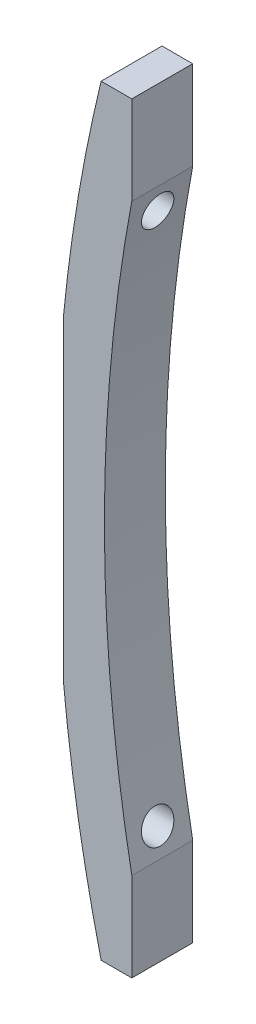
ISO-10303-21;
HEADER;
FILE_DESCRIPTION(('STEP AP214'),'2;1');
FILE_NAME('part.step','',(''),(''),'','','');
FILE_SCHEMA(('AUTOMOTIVE_DESIGN { 1 0 10303 214 1 1 1 1 }'));
ENDSEC;
DATA;
#1=APPLICATION_CONTEXT('core data for automotive mechanical design processes');
#2=APPLICATION_PROTOCOL_DEFINITION('international standard','automotive_design',2000,#1);
#3=PRODUCT_CONTEXT('',#1,'mechanical');
#4=PRODUCT('Part','Part','',(#3));
#5=PRODUCT_RELATED_PRODUCT_CATEGORY('part','',(#4));
#6=PRODUCT_DEFINITION_FORMATION('','',#4);
#7=PRODUCT_DEFINITION_CONTEXT('part definition',#1,'design');
#8=PRODUCT_DEFINITION('design','',#6,#7);
#9=PRODUCT_DEFINITION_SHAPE('','',#8);
#10=(LENGTH_UNIT() NAMED_UNIT(*) SI_UNIT(.MILLI.,.METRE.));
#11=(NAMED_UNIT(*) PLANE_ANGLE_UNIT() SI_UNIT($,.RADIAN.));
#12=(NAMED_UNIT(*) SI_UNIT($,.STERADIAN.) SOLID_ANGLE_UNIT());
#13=UNCERTAINTY_MEASURE_WITH_UNIT(LENGTH_MEASURE(1.E-05),#10,'distance_accuracy_value','');
#14=(GEOMETRIC_REPRESENTATION_CONTEXT(3) GLOBAL_UNCERTAINTY_ASSIGNED_CONTEXT((#13)) GLOBAL_UNIT_ASSIGNED_CONTEXT((#10,
#11,#12)) REPRESENTATION_CONTEXT('',''));
#15=CARTESIAN_POINT('',(0.,0.,0.));
#16=DIRECTION('',(0.,0.,1.));
#17=DIRECTION('',(1.,0.,0.));
#18=AXIS2_PLACEMENT_3D('',#15,#16,#17);
#19=CARTESIAN_POINT('',(0.,0.,8.));
#20=DIRECTION('',(0.,0.,-1.));
#21=DIRECTION('',(-1.,0.,0.));
#22=AXIS2_PLACEMENT_3D('',#19,#20,#21);
#23=CYLINDRICAL_SURFACE('',#22,212.4);
#24=CARTESIAN_POINT('',(-209.4964438839,35.,1.90000000000001));
#25=CARTESIAN_POINT('',(-209.476511381368,35.1193073421392,1.90000511184123));
#26=CARTESIAN_POINT('',(-209.456461650827,35.2386843955293,1.91019918332409));
#27=CARTESIAN_POINT('',(-209.416713524346,35.4741370640329,1.9507326093201));
#28=CARTESIAN_POINT('',(-209.397015589484,35.5902084502996,1.98109665698785));
#29=CARTESIAN_POINT('',(-209.358577223821,35.8156280588949,2.06117372701381));
#30=CARTESIAN_POINT('',(-209.339836571926,35.9249778348495,2.11088225848665));
#31=CARTESIAN_POINT('',(-209.303896620308,36.1337805423377,2.22830991470027));
#32=CARTESIAN_POINT('',(-209.286696894943,36.2332362077129,2.29602404521435));
#33=CARTESIAN_POINT('',(-209.254481958036,36.4188222934256,2.44720052984125));
#34=CARTESIAN_POINT('',(-209.239455034992,36.5050243241536,2.53057242445303));
#35=CARTESIAN_POINT('',(-209.21197777184,36.6621703871992,2.71100816209119));
#36=CARTESIAN_POINT('',(-209.199527355566,36.7331148705546,2.80807160023294));
#37=CARTESIAN_POINT('',(-209.177792656656,36.8566812951015,3.01170680739767));
#38=CARTESIAN_POINT('',(-209.168467113492,36.9095422226952,3.11812914027043));
#39=CARTESIAN_POINT('',(-209.153080698746,36.9966323230944,3.33856258903509));
#40=CARTESIAN_POINT('',(-209.147019538543,37.0308631430846,3.45257303302202));
#41=CARTESIAN_POINT('',(-209.138442507443,37.0792727421971,3.68325937577144));
#42=CARTESIAN_POINT('',(-209.135879004865,37.0937209341907,3.79987701810184));
#43=CARTESIAN_POINT('',(-209.13423497116,37.102988928925,4.03391129456041));
#44=CARTESIAN_POINT('',(-209.135154256808,37.097809764232,4.15132788633264));
#45=CARTESIAN_POINT('',(-209.140424007965,37.068089592285,4.38279116544708));
#46=CARTESIAN_POINT('',(-209.144751199666,37.0436799166782,4.49685528683648));
#47=CARTESIAN_POINT('',(-209.156654281565,36.9764131152066,4.71922530876568));
#48=CARTESIAN_POINT('',(-209.164230194711,36.9335558590345,4.82753116862503));
#49=CARTESIAN_POINT('',(-209.182400910131,36.8305020768347,5.03576377168684));
#50=CARTESIAN_POINT('',(-209.19300654289,36.7702433363217,5.13565875892738));
#51=CARTESIAN_POINT('',(-209.216867115419,36.6342362630164,5.32391816768819));
#52=CARTESIAN_POINT('',(-209.230122200872,36.5584870784589,5.41228195471024));
#53=CARTESIAN_POINT('',(-209.259024988799,36.3926862162232,5.57612533225323));
#54=CARTESIAN_POINT('',(-209.274699566994,36.3024733768893,5.65143705943532));
#55=CARTESIAN_POINT('',(-209.307824334859,36.1109969443033,5.78588180985315));
#56=CARTESIAN_POINT('',(-209.325274661247,36.0097325001328,5.84501358608256));
#57=CARTESIAN_POINT('',(-209.361683768244,35.7974457136266,5.94630672737467));
#58=CARTESIAN_POINT('',(-209.380660724031,35.6863033663887,5.98821011954287));
#59=CARTESIAN_POINT('',(-209.419330854139,35.4586687266936,6.05271043230486));
#60=CARTESIAN_POINT('',(-209.439024073987,35.3421760940412,6.07530612343224));
#61=CARTESIAN_POINT('',(-209.478762816225,35.1058744704903,6.10072693559987));
#62=CARTESIAN_POINT('',(-209.498809884374,34.9860437948711,6.10334852327774));
#63=CARTESIAN_POINT('',(-209.538489258518,34.7476060954839,6.08819744678148));
#64=CARTESIAN_POINT('',(-209.558121555132,34.6289990994197,6.07042432189288));
#65=CARTESIAN_POINT('',(-209.596459904149,34.3961908079817,6.01488415102494));
#66=CARTESIAN_POINT('',(-209.615164390364,34.2819970295926,5.97708447663329));
#67=CARTESIAN_POINT('',(-209.651102189727,34.0615301547312,5.8824618452811));
#68=CARTESIAN_POINT('',(-209.668335543321,33.9552568405098,5.82563941152989));
#69=CARTESIAN_POINT('',(-209.700752860365,33.7544743045071,5.6949669667323));
#70=CARTESIAN_POINT('',(-209.715950265954,33.6598882776994,5.62123835013196));
#71=CARTESIAN_POINT('',(-209.744033322588,33.4844500384186,5.45856624554176));
#72=CARTESIAN_POINT('',(-209.756919117247,33.4035969727693,5.36962370342428));
#73=CARTESIAN_POINT('',(-209.779900275704,33.2589650391363,5.18018211280599));
#74=CARTESIAN_POINT('',(-209.790027127726,33.1949937860473,5.07983377041791));
#75=CARTESIAN_POINT('',(-209.807429700826,33.0848238285912,4.86958743086771));
#76=CARTESIAN_POINT('',(-209.814705620933,33.0386238835952,4.75969010098465));
#77=CARTESIAN_POINT('',(-209.826150779175,32.9658580835335,4.5348513437396));
#78=CARTESIAN_POINT('',(-209.830355386039,32.9390687293574,4.41998401909135));
#79=CARTESIAN_POINT('',(-209.835689703455,32.9050699541181,4.18731880320775));
#80=CARTESIAN_POINT('',(-209.836819555757,32.8978596304271,4.06952104732311));
#81=CARTESIAN_POINT('',(-209.835978942063,32.9032209156955,3.83521053438799));
#82=CARTESIAN_POINT('',(-209.834029959527,32.9156554470541,3.71869453547438));
#83=CARTESIAN_POINT('',(-209.827120764317,32.9596705343738,3.48943158535022));
#84=CARTESIAN_POINT('',(-209.822160576402,32.9912509329181,3.37668460315894));
#85=CARTESIAN_POINT('',(-209.809351532139,33.0726124531629,3.15810941896334));
#86=CARTESIAN_POINT('',(-209.801501982547,33.1223979427934,3.05228288456456));
#87=CARTESIAN_POINT('',(-209.783110711897,33.2386809369034,2.85051586610427));
#88=CARTESIAN_POINT('',(-209.77256902277,33.3051782431671,2.75457526480652));
#89=CARTESIAN_POINT('',(-209.748971930599,33.4534667114208,2.57454133041834));
#90=CARTESIAN_POINT('',(-209.735899147327,33.5353634977425,2.49053730850978));
#91=CARTESIAN_POINT('',(-209.707614609039,33.7117834135195,2.33742866378606));
#92=CARTESIAN_POINT('',(-209.692402208396,33.8063103536729,2.26832855420835));
#93=CARTESIAN_POINT('',(-209.660031650848,34.0064924025233,2.14612122972163));
#94=CARTESIAN_POINT('',(-209.642852075718,34.1122688929184,2.09321878691719));
#95=CARTESIAN_POINT('',(-209.607159254745,34.3309046126272,2.00597471814416));
#96=CARTESIAN_POINT('',(-209.588647513317,34.443755834448,1.97161251622471));
#97=CARTESIAN_POINT('',(-209.557759389626,34.6310686439729,1.93132724926289));
#98=CARTESIAN_POINT('',(-209.54563240496,34.7043732087947,1.91959193283355));
#99=CARTESIAN_POINT('',(-209.521166659529,34.851776209093,1.90392669395726));
#100=CARTESIAN_POINT('',(-209.508827897338,34.9258746499074,1.89999682402597));
#101=CARTESIAN_POINT('',(-209.4964438839,35.,1.90000000000001));
#102=B_SPLINE_CURVE_WITH_KNOTS('',3,(#24,#25,#26,#27,#28,#29,#30,#31,#32,#33,#34,#35,#36,#37,
#38,#39,#40,#41,#42,#43,#44,#45,#46,#47,#48,#49,#50,#51,#52,#53,#54,#55,#56,#57,#58,#59,#60,#61,
#62,#63,#64,#65,#66,#67,#68,#69,#70,#71,#72,#73,#74,#75,#76,#77,#78,#79,#80,#81,#82,#83,#84,#85,
#86,#87,#88,#89,#90,#91,#92,#93,#94,#95,#96,#97,#98,#99,#100,#101),.UNSPECIFIED.,.T.,.F.,(4,2,2,
2,2,2,2,2,2,2,2,2,2,2,2,2,2,2,2,2,2,2,2,2,2,2,2,2,2,2,2,2,2,2,2,2,2,2,4),(0.,0.362609864945201,
0.725664476294924,1.08863485355767,1.45150465827947,1.81233918410767,2.17316304161866,
2.52901533486004,2.88483616023785,3.23576130124209,3.58666798084959,3.93519875864318,
4.28373199837907,4.6335270910959,4.98334142299545,5.33736584762662,5.69141754962309,
6.05059294792681,6.40979121592268,6.77264483171402,7.13550664449287,7.4989614790189,
7.86240631776388,8.22331893013835,8.58420911218919,8.9407891718395,9.29734433384064,
9.64972579079827,10.002091002076,10.3520083234443,10.7019227678384,11.0519212220122,
11.4019155251133,11.7544043033499,12.106999673659,12.4638842191678,12.8203718754166,
13.0456589521777,13.2709475446831),.UNSPECIFIED.);
#103=CARTESIAN_POINT('',(-209.4964438839,35.,1.90000000000001));
#104=VERTEX_POINT('',#103);
#105=EDGE_CURVE('E152',#104,#104,#102,.T.);
#106=ORIENTED_EDGE('',*,*,#105,.T.);
#107=EDGE_LOOP('',(#106));
#108=FACE_BOUND('',#107,.T.);
#109=DIRECTION('',(0.,0.,-1.));
#110=VECTOR('',#109,1.);
#111=CARTESIAN_POINT('',(-211.4,20.5864032798354,8.));
#112=LINE('',#111,#110);
#113=CARTESIAN_POINT('',(-211.4,20.5864032798354,8.));
#114=VERTEX_POINT('',#113);
#115=CARTESIAN_POINT('',(-211.4,20.5864032798354,0.));
#116=VERTEX_POINT('',#115);
#117=EDGE_CURVE('E44',#114,#116,#112,.T.);
#118=ORIENTED_EDGE('',*,*,#117,.F.);
#119=CARTESIAN_POINT('',(0.,0.,8.));
#120=DIRECTION('',(0.,0.,1.));
#121=DIRECTION('',(1.,0.,0.));
#122=AXIS2_PLACEMENT_3D('',#119,#120,#121);
#123=CIRCLE('',#122,212.4);
#124=CARTESIAN_POINT('',(-206.43100542312,50.,8.));
#125=VERTEX_POINT('',#124);
#126=EDGE_CURVE('E181',#125,#114,#123,.T.);
#127=ORIENTED_EDGE('',*,*,#126,.F.);
#128=DIRECTION('',(0.,0.,-1.));
#129=VECTOR('',#128,1.);
#130=CARTESIAN_POINT('',(-206.43100542312,50.,8.));
#131=LINE('',#130,#129);
#132=CARTESIAN_POINT('',(-206.43100542312,50.,0.));
#133=VERTEX_POINT('',#132);
#134=EDGE_CURVE('E122',#125,#133,#131,.T.);
#135=ORIENTED_EDGE('',*,*,#134,.T.);
#136=CARTESIAN_POINT('',(0.,0.,0.));
#137=DIRECTION('',(0.,0.,1.));
#138=DIRECTION('',(1.,0.,0.));
#139=AXIS2_PLACEMENT_3D('',#136,#137,#138);
#140=CIRCLE('',#139,212.4);
#141=EDGE_CURVE('E126',#133,#116,#140,.T.);
#142=ORIENTED_EDGE('',*,*,#141,.T.);
#143=EDGE_LOOP('',(#118,#127,#135,#142));
#144=FACE_BOUND('',#143,.T.);
#145=ADVANCED_FACE('F30',(#108,#144),#23,.T.);
#146=CARTESIAN_POINT('',(-209.4964438839,-35.,1.90000000000001));
#147=CARTESIAN_POINT('',(-209.516334347274,-34.8809425050941,1.90000506557466));
#148=CARTESIAN_POINT('',(-209.53613677237,-34.7617826618332,1.91015631300565));
#149=CARTESIAN_POINT('',(-209.575003330924,-34.5266885394709,1.9505530687163));
#150=CARTESIAN_POINT('',(-209.594066559866,-34.410758258185,1.98082242132139));
#151=CARTESIAN_POINT('',(-209.630917701722,-34.1855431790759,2.06068918699154));
#152=CARTESIAN_POINT('',(-209.6487057905,-34.0762574651747,2.11028392867272));
#153=CARTESIAN_POINT('',(-209.682524209704,-33.8675395034087,2.22747234730053));
#154=CARTESIAN_POINT('',(-209.698555021984,-33.7681045551449,2.29506107270253));
#155=CARTESIAN_POINT('',(-209.728335171615,-33.5826473538398,2.44587691119796));
#156=CARTESIAN_POINT('',(-209.742099284049,-33.4965384787834,2.52899453933625));
#157=CARTESIAN_POINT('',(-209.767115682103,-33.3395188443591,2.70885652592744));
#158=CARTESIAN_POINT('',(-209.778368028175,-33.2686077192115,2.80560055632696));
#159=CARTESIAN_POINT('',(-209.797942178274,-33.1449444652487,3.00867433430653));
#160=CARTESIAN_POINT('',(-209.806298699631,-33.091977395394,3.11486985173226));
#161=CARTESIAN_POINT('',(-209.820058631162,-33.004620348421,3.33482346030437));
#162=CARTESIAN_POINT('',(-209.825462241698,-32.9702291108899,3.44858103775934));
#163=CARTESIAN_POINT('',(-209.833136632289,-32.9213514670943,3.67912806399052));
#164=CARTESIAN_POINT('',(-209.835440117704,-32.9066572698651,3.79587240450094));
#165=CARTESIAN_POINT('',(-209.836962864715,-32.8969457848957,4.03019462540015));
#166=CARTESIAN_POINT('',(-209.836182246167,-32.9019277324932,4.14777247321956));
#167=CARTESIAN_POINT('',(-209.831568061165,-32.931341607874,4.37982199868813));
#168=CARTESIAN_POINT('',(-209.827749380774,-32.9556786980521,4.49430601460737));
#169=CARTESIAN_POINT('',(-209.817173193788,-33.0229463058931,4.71752860327866));
#170=CARTESIAN_POINT('',(-209.810415679567,-33.0658768718084,4.82626716111968));
#171=CARTESIAN_POINT('',(-209.794109734865,-33.1691761717115,5.03523075784059));
#172=CARTESIAN_POINT('',(-209.784554309205,-33.22958860838,5.13543363574282));
#173=CARTESIAN_POINT('',(-209.762898042781,-33.3660210439898,5.32426682591713));
#174=CARTESIAN_POINT('',(-209.750797105019,-33.4420416376784,5.4128966969903));
#175=CARTESIAN_POINT('',(-209.72423270238,-33.6082332934843,5.57693993722774));
#176=CARTESIAN_POINT('',(-209.709748996835,-33.6985253024304,5.65222746816091));
#177=CARTESIAN_POINT('',(-209.678865466307,-33.8901576163119,5.78660226503986));
#178=CARTESIAN_POINT('',(-209.662465521776,-33.9914986105295,5.84568851947255));
#179=CARTESIAN_POINT('',(-209.627957318531,-34.2036721550891,5.94675046585983));
#180=CARTESIAN_POINT('',(-209.609830592165,-34.3146057792696,5.98850766095199));
#181=CARTESIAN_POINT('',(-209.572520226747,-34.5417429616551,6.05278690860418));
#182=CARTESIAN_POINT('',(-209.553336519772,-34.657946858449,6.07530772347365));
#183=CARTESIAN_POINT('',(-209.514215046057,-34.8936686952953,6.10068952182996));
#184=CARTESIAN_POINT('',(-209.494271363404,-35.0132088957882,6.10333497875319));
#185=CARTESIAN_POINT('',(-209.454387684157,-35.251014449032,6.08834559401853));
#186=CARTESIAN_POINT('',(-209.434447687741,-35.3692797510467,6.07070994823361));
#187=CARTESIAN_POINT('',(-209.395057015434,-35.6017424371453,6.01550054589518));
#188=CARTESIAN_POINT('',(-209.375609012663,-35.7159186039005,5.97783543794968));
#189=CARTESIAN_POINT('',(-209.337887796752,-35.9363499549881,5.88351259211978));
#190=CARTESIAN_POINT('',(-209.319614572871,-36.042605211746,5.8268550279206));
#191=CARTESIAN_POINT('',(-209.284898911817,-36.2436403008732,5.69636533743794));
#192=CARTESIAN_POINT('',(-209.268448694886,-36.3384690607516,5.62261070281932));
#193=CARTESIAN_POINT('',(-209.237827795232,-36.5143726023221,5.45980627834351));
#194=CARTESIAN_POINT('',(-209.223656971875,-36.5954482325644,5.37075743280197));
#195=CARTESIAN_POINT('',(-209.198240251512,-36.7404633276425,5.18104511075277));
#196=CARTESIAN_POINT('',(-209.186960556887,-36.8046010952588,5.08053777850729));
#197=CARTESIAN_POINT('',(-209.16749744336,-36.9150534843566,4.86989033063791));
#198=CARTESIAN_POINT('',(-209.15931375162,-36.9613696763911,4.75975106489284));
#199=CARTESIAN_POINT('',(-209.146434072525,-37.0341797661233,4.53469384522014));
#200=CARTESIAN_POINT('',(-209.141688968947,-37.0609528564393,4.41986899024782));
#201=CARTESIAN_POINT('',(-209.13566487741,-37.0949320032118,4.18727270130226));
#202=CARTESIAN_POINT('',(-209.134385667168,-37.1021393145145,4.06950145678392));
#203=CARTESIAN_POINT('',(-209.13533501959,-37.0967876094843,3.83555685417004));
#204=CARTESIAN_POINT('',(-209.137530117128,-37.0844171695019,3.71937899280055));
#205=CARTESIAN_POINT('',(-209.145286638956,-37.0406474619604,3.49078445052232));
#206=CARTESIAN_POINT('',(-209.15084803025,-37.0092483809276,3.37836773275676));
#207=CARTESIAN_POINT('',(-209.165143081629,-36.9283711376846,3.16041615432416));
#208=CARTESIAN_POINT('',(-209.173877790643,-36.8788869974934,3.05488358280721));
#209=CARTESIAN_POINT('',(-209.194218389165,-36.7633298275446,2.85364406513486));
#210=CARTESIAN_POINT('',(-209.205824285733,-36.6972567569937,2.75793714314224));
#211=CARTESIAN_POINT('',(-209.231648658479,-36.5497311421157,2.57803003498749));
#212=CARTESIAN_POINT('',(-209.245891614221,-36.4681342782541,2.49395175555415));
#213=CARTESIAN_POINT('',(-209.276456176152,-36.2923247639038,2.34063107161643));
#214=CARTESIAN_POINT('',(-209.292778442148,-36.1981081084128,2.27139339512154));
#215=CARTESIAN_POINT('',(-209.327247313703,-35.9982494049829,2.14866011940055));
#216=CARTESIAN_POINT('',(-209.345417530589,-35.8924576983801,2.09541514600806));
#217=CARTESIAN_POINT('',(-209.38280747374,-35.673690617898,2.00751165791372));
#218=CARTESIAN_POINT('',(-209.40202602074,-35.5607232932554,1.97283271473416));
#219=CARTESIAN_POINT('',(-209.433871166474,-35.3725762550628,1.93195502606188));
#220=CARTESIAN_POINT('',(-209.446356517631,-35.2985755409601,1.91998681069539));
#221=CARTESIAN_POINT('',(-209.471387483411,-35.1497300531286,1.90400767035298));
#222=CARTESIAN_POINT('',(-209.483933098552,-35.074885272144,1.89999681383406));
#223=CARTESIAN_POINT('',(-209.4964438839,-35.,1.90000000000001));
#224=B_SPLINE_CURVE_WITH_KNOTS('',3,(#146,#147,#148,#149,#150,#151,#152,#153,#154,#155,#156,
#157,#158,#159,#160,#161,#162,#163,#164,#165,#166,#167,#168,#169,#170,#171,#172,#173,#174,#175,
#176,#177,#178,#179,#180,#181,#182,#183,#184,#185,#186,#187,#188,#189,#190,#191,#192,#193,#194,
#195,#196,#197,#198,#199,#200,#201,#202,#203,#204,#205,#206,#207,#208,#209,#210,#211,#212,#213,
#214,#215,#216,#217,#218,#219,#220,#221,#222,#223),.UNSPECIFIED.,.T.,.F.,(4,2,2,2,2,2,2,2,2,2,2,
2,2,2,2,2,2,2,2,2,2,2,2,2,2,2,2,2,2,2,2,2,2,2,2,2,2,2,4),(0.,0.361847908858442,
0.724125452711875,1.08635293603265,1.44848084523978,1.80814587751551,2.16780225239494,
2.52298413173438,2.87814190814486,3.22952271415615,3.58088986479662,3.93054589263692,
4.28020282788468,4.63074153051388,4.98129359286576,5.33499377597672,5.68871603703579,
6.04677188832523,6.40485077559974,6.76680710889976,7.12877779392941,7.49241371346893,
7.85604630766374,8.2180619112622,8.58005517083869,8.9376008407282,9.29511499415308,
9.64741602420243,9.99969445898059,10.3486002847934,10.6975026905485,11.0465205297782,
11.3955392272755,11.747976978538,12.10052684522,12.4583435119892,12.8157656543695,
13.043360280297,13.270956864208),.UNSPECIFIED.);
#225=CARTESIAN_POINT('',(-209.4964438839,-35.,1.90000000000001));
#226=VERTEX_POINT('',#225);
#227=EDGE_CURVE('E153',#226,#226,#224,.T.);
#228=ORIENTED_EDGE('',*,*,#227,.T.);
#229=EDGE_LOOP('',(#228));
#230=FACE_BOUND('',#229,.T.);
#231=DIRECTION('',(0.,0.,-1.));
#232=VECTOR('',#231,1.);
#233=CARTESIAN_POINT('',(-211.4,-20.5864032798354,8.));
#234=LINE('',#233,#232);
#235=CARTESIAN_POINT('',(-211.4,-20.5864032798354,0.));
#236=VERTEX_POINT('',#235);
#237=CARTESIAN_POINT('',(-211.4,-20.5864032798354,8.));
#238=VERTEX_POINT('',#237);
#239=EDGE_CURVE('E204',#236,#238,#234,.F.);
#240=ORIENTED_EDGE('',*,*,#239,.F.);
#241=CARTESIAN_POINT('',(-206.43100542312,-50.,0.));
#242=VERTEX_POINT('',#241);
#243=EDGE_CURVE('E130',#236,#242,#140,.T.);
#244=ORIENTED_EDGE('',*,*,#243,.T.);
#245=DIRECTION('',(0.,0.,-1.));
#246=VECTOR('',#245,1.);
#247=CARTESIAN_POINT('',(-206.43100542312,-50.,8.));
#248=LINE('',#247,#246);
#249=CARTESIAN_POINT('',(-206.43100542312,-50.,8.));
#250=VERTEX_POINT('',#249);
#251=EDGE_CURVE('E38',#250,#242,#248,.T.);
#252=ORIENTED_EDGE('',*,*,#251,.F.);
#253=EDGE_CURVE('E88',#238,#250,#123,.T.);
#254=ORIENTED_EDGE('',*,*,#253,.F.);
#255=EDGE_LOOP('',(#240,#244,#252,#254));
#256=FACE_BOUND('',#255,.T.);
#257=ADVANCED_FACE('F207',(#230,#256),#23,.T.);
#258=CARTESIAN_POINT('',(0.,0.,8.));
#259=DIRECTION('',(0.,0.,1.));
#260=DIRECTION('',(1.,0.,0.));
#261=AXIS2_PLACEMENT_3D('',#258,#259,#260);
#262=PLANE('',#261);
#263=ORIENTED_EDGE('',*,*,#126,.T.);
#264=DIRECTION('',(0.,-1.,0.));
#265=VECTOR('',#264,1.);
#266=CARTESIAN_POINT('',(-211.4,0.,8.));
#267=LINE('',#266,#265);
#268=EDGE_CURVE('E198',#114,#238,#267,.T.);
#269=ORIENTED_EDGE('',*,*,#268,.T.);
#270=ORIENTED_EDGE('',*,*,#253,.T.);
#271=DIRECTION('',(1.,0.,0.));
#272=VECTOR('',#271,1.);
#273=CARTESIAN_POINT('',(-206.43100542312,-50.,8.));
#274=LINE('',#273,#272);
#275=CARTESIAN_POINT('',(-202.4,-50.,8.));
#276=VERTEX_POINT('',#275);
#277=EDGE_CURVE('E183',#250,#276,#274,.T.);
#278=ORIENTED_EDGE('',*,*,#277,.T.);
#279=DIRECTION('',(0.,1.,0.));
#280=VECTOR('',#279,1.);
#281=CARTESIAN_POINT('',(-202.4,-38.3437087408091,8.));
#282=LINE('',#281,#280);
#283=CARTESIAN_POINT('',(-202.4,-38.343708740809,8.));
#284=VERTEX_POINT('',#283);
#285=EDGE_CURVE('E105',#276,#284,#282,.T.);
#286=ORIENTED_EDGE('',*,*,#285,.T.);
#287=CARTESIAN_POINT('',(0.,0.,8.));
#288=DIRECTION('',(0.,0.,-1.));
#289=DIRECTION('',(1.,0.,0.));
#290=AXIS2_PLACEMENT_3D('',#287,#288,#289);
#291=CIRCLE('',#290,206.);
#292=CARTESIAN_POINT('',(-202.4,38.3437087408091,8.));
#293=VERTEX_POINT('',#292);
#294=EDGE_CURVE('E98',#284,#293,#291,.T.);
#295=ORIENTED_EDGE('',*,*,#294,.T.);
#296=DIRECTION('',(0.,1.,0.));
#297=VECTOR('',#296,1.);
#298=CARTESIAN_POINT('',(-202.4,50.,8.));
#299=LINE('',#298,#297);
#300=CARTESIAN_POINT('',(-202.4,50.,8.));
#301=VERTEX_POINT('',#300);
#302=EDGE_CURVE('E102',#293,#301,#299,.T.);
#303=ORIENTED_EDGE('',*,*,#302,.T.);
#304=DIRECTION('',(-1.,0.,0.));
#305=VECTOR('',#304,1.);
#306=CARTESIAN_POINT('',(-206.43100542312,50.,8.));
#307=LINE('',#306,#305);
#308=EDGE_CURVE('E53',#301,#125,#307,.T.);
#309=ORIENTED_EDGE('',*,*,#308,.T.);
#310=EDGE_LOOP('',(#263,#269,#270,#278,#286,#295,#303,#309));
#311=FACE_BOUND('',#310,.T.);
#312=ADVANCED_FACE('F100',(#311),#262,.T.);
#313=CARTESIAN_POINT('',(0.,0.,0.));
#314=DIRECTION('',(0.,0.,1.));
#315=DIRECTION('',(1.,0.,0.));
#316=AXIS2_PLACEMENT_3D('',#313,#314,#315);
#317=PLANE('',#316);
#318=DIRECTION('',(0.,-1.,0.));
#319=VECTOR('',#318,1.);
#320=CARTESIAN_POINT('',(-211.4,0.,0.));
#321=LINE('',#320,#319);
#322=EDGE_CURVE('E11',#116,#236,#321,.T.);
#323=ORIENTED_EDGE('',*,*,#322,.F.);
#324=ORIENTED_EDGE('',*,*,#141,.F.);
#325=DIRECTION('',(-1.,0.,0.));
#326=VECTOR('',#325,1.);
#327=CARTESIAN_POINT('',(-206.43100542312,50.,0.));
#328=LINE('',#327,#326);
#329=CARTESIAN_POINT('',(-202.4,50.,0.));
#330=VERTEX_POINT('',#329);
#331=EDGE_CURVE('E80',#330,#133,#328,.T.);
#332=ORIENTED_EDGE('',*,*,#331,.F.);
#333=DIRECTION('',(0.,1.,0.));
#334=VECTOR('',#333,1.);
#335=CARTESIAN_POINT('',(-202.4,50.,0.));
#336=LINE('',#335,#334);
#337=CARTESIAN_POINT('',(-202.4,38.3437087408091,0.));
#338=VERTEX_POINT('',#337);
#339=EDGE_CURVE('E135',#338,#330,#336,.T.);
#340=ORIENTED_EDGE('',*,*,#339,.F.);
#341=CARTESIAN_POINT('',(0.,0.,0.));
#342=DIRECTION('',(0.,0.,-1.));
#343=DIRECTION('',(1.,0.,0.));
#344=AXIS2_PLACEMENT_3D('',#341,#342,#343);
#345=CIRCLE('',#344,206.);
#346=CARTESIAN_POINT('',(-202.4,-38.343708740809,0.));
#347=VERTEX_POINT('',#346);
#348=EDGE_CURVE('E114',#347,#338,#345,.T.);
#349=ORIENTED_EDGE('',*,*,#348,.F.);
#350=DIRECTION('',(0.,1.,0.));
#351=VECTOR('',#350,1.);
#352=CARTESIAN_POINT('',(-202.4,-38.3437087408091,0.));
#353=LINE('',#352,#351);
#354=CARTESIAN_POINT('',(-202.4,-50.,0.));
#355=VERTEX_POINT('',#354);
#356=EDGE_CURVE('E132',#355,#347,#353,.T.);
#357=ORIENTED_EDGE('',*,*,#356,.F.);
#358=DIRECTION('',(1.,0.,0.));
#359=VECTOR('',#358,1.);
#360=CARTESIAN_POINT('',(-206.43100542312,-50.,0.));
#361=LINE('',#360,#359);
#362=EDGE_CURVE('E129',#242,#355,#361,.T.);
#363=ORIENTED_EDGE('',*,*,#362,.F.);
#364=ORIENTED_EDGE('',*,*,#243,.F.);
#365=EDGE_LOOP('',(#323,#324,#332,#340,#349,#357,#363,#364));
#366=FACE_BOUND('',#365,.T.);
#367=ADVANCED_FACE('F193',(#366),#317,.F.);
#368=CARTESIAN_POINT('',(-206.43100542312,-50.,8.));
#369=DIRECTION('',(0.,1.,0.));
#370=DIRECTION('',(-1.,0.,0.));
#371=AXIS2_PLACEMENT_3D('',#368,#369,#370);
#372=PLANE('',#371);
#373=ORIENTED_EDGE('',*,*,#362,.T.);
#374=DIRECTION('',(0.,0.,-1.));
#375=VECTOR('',#374,1.);
#376=CARTESIAN_POINT('',(-202.4,-50.,8.));
#377=LINE('',#376,#375);
#378=EDGE_CURVE('E141',#276,#355,#377,.T.);
#379=ORIENTED_EDGE('',*,*,#378,.F.);
#380=ORIENTED_EDGE('',*,*,#277,.F.);
#381=ORIENTED_EDGE('',*,*,#251,.T.);
#382=EDGE_LOOP('',(#373,#379,#380,#381));
#383=FACE_BOUND('',#382,.T.);
#384=ADVANCED_FACE('F187',(#383),#372,.F.);
#385=CARTESIAN_POINT('',(-202.4,-38.3437087408091,8.));
#386=DIRECTION('',(-1.,0.,0.));
#387=DIRECTION('',(0.,0.,1.));
#388=AXIS2_PLACEMENT_3D('',#385,#386,#387);
#389=PLANE('',#388);
#390=ORIENTED_EDGE('',*,*,#356,.T.);
#391=DIRECTION('',(0.,0.,-1.));
#392=VECTOR('',#391,1.);
#393=CARTESIAN_POINT('',(-202.4,-38.343708740809,8.));
#394=LINE('',#393,#392);
#395=EDGE_CURVE('E117',#284,#347,#394,.T.);
#396=ORIENTED_EDGE('',*,*,#395,.F.);
#397=ORIENTED_EDGE('',*,*,#285,.F.);
#398=ORIENTED_EDGE('',*,*,#378,.T.);
#399=EDGE_LOOP('',(#390,#396,#397,#398));
#400=FACE_BOUND('',#399,.T.);
#401=ADVANCED_FACE('F191',(#400),#389,.F.);
#402=CARTESIAN_POINT('',(0.,0.,8.));
#403=DIRECTION('',(0.,0.,-1.));
#404=DIRECTION('',(-1.,0.,0.));
#405=AXIS2_PLACEMENT_3D('',#402,#403,#404);
#406=CYLINDRICAL_SURFACE('',#405,206.);
#407=CARTESIAN_POINT('',(-203.004926048606,-35.,1.90000000000001));
#408=CARTESIAN_POINT('',(-202.984340979378,-35.1193953978313,1.90000510427262));
#409=CARTESIAN_POINT('',(-202.963634758591,-35.2388594739598,1.91021410132035));
#410=CARTESIAN_POINT('',(-202.922584794482,-35.4744828103525,1.95080742036756));
#411=CARTESIAN_POINT('',(-202.902241527625,-35.5906378311323,1.98121650798628));
#412=CARTESIAN_POINT('',(-202.862543310707,-35.8162202785931,2.06141691021567));
#413=CARTESIAN_POINT('',(-202.843188147914,-35.9256491544096,2.11120403279576));
#414=CARTESIAN_POINT('',(-202.806070251162,-36.1345975858775,2.22882556162877));
#415=CARTESIAN_POINT('',(-202.788307074434,-36.2341198976415,2.29665492894183));
#416=CARTESIAN_POINT('',(-202.755045284541,-36.4197812884926,2.44807103937439));
#417=CARTESIAN_POINT('',(-202.739533746845,-36.5059969452765,2.5315609851896));
#418=CARTESIAN_POINT('',(-202.711173888554,-36.6631473573104,2.71225970468382));
#419=CARTESIAN_POINT('',(-202.698325476592,-36.7340826368008,2.80946800752287));
#420=CARTESIAN_POINT('',(-202.675912745911,-36.8575404320543,3.01332120792315));
#421=CARTESIAN_POINT('',(-202.666303019336,-36.9103177707632,3.11980677040805));
#422=CARTESIAN_POINT('',(-202.650455008596,-36.9972302994199,3.34036594062242));
#423=CARTESIAN_POINT('',(-202.644216406924,-37.0313672450053,3.45443883260677));
#424=CARTESIAN_POINT('',(-202.63540473035,-37.0795542901822,3.68513853855553));
#425=CARTESIAN_POINT('',(-202.632779334067,-37.0938911182607,3.80170352205066));
#426=CARTESIAN_POINT('',(-202.631119518187,-37.1029571106212,4.0356159814726));
#427=CARTESIAN_POINT('',(-202.632084898485,-37.0976873675297,4.15296341343168));
#428=CARTESIAN_POINT('',(-202.637551131713,-37.0678174986182,4.38422360780227));
#429=CARTESIAN_POINT('',(-202.642026540906,-37.0433564873299,4.4981549861709));
#430=CARTESIAN_POINT('',(-202.654321870921,-36.9760326216095,4.72025019723458));
#431=CARTESIAN_POINT('',(-202.662141817268,-36.9331696267402,4.82841398590641));
#432=CARTESIAN_POINT('',(-202.680890563629,-36.8301417156491,5.03638840180471));
#433=CARTESIAN_POINT('',(-202.691831299673,-36.7699103611135,5.13616501635156));
#434=CARTESIAN_POINT('',(-202.716438678127,-36.6340039324586,5.3241942017904));
#435=CARTESIAN_POINT('',(-202.730105479837,-36.5583279558147,5.41244609872752));
#436=CARTESIAN_POINT('',(-202.759911609891,-36.3926558709356,5.57614832586293));
#437=CARTESIAN_POINT('',(-202.776080377572,-36.302488687797,5.65142012275229));
#438=CARTESIAN_POINT('',(-202.810245786117,-36.1111290166397,5.78579525853068));
#439=CARTESIAN_POINT('',(-202.828242576262,-36.0099356281395,5.84489727549));
#440=CARTESIAN_POINT('',(-202.865806334051,-35.7977149461691,5.94619789379274));
#441=CARTESIAN_POINT('',(-202.885393207733,-35.6865602530769,5.9881222871153));
#442=CARTESIAN_POINT('',(-202.925305104779,-35.4589043607094,6.05265867934178));
#443=CARTESIAN_POINT('',(-202.945630177987,-35.3424028002724,6.07526937164523));
#444=CARTESIAN_POINT('',(-202.986656907016,-35.106006006864,6.10072525799043));
#445=CARTESIAN_POINT('',(-203.00736025773,-34.9860876903411,6.10335386951606));
#446=CARTESIAN_POINT('',(-203.04833864056,-34.747472323625,6.08818638841699));
#447=CARTESIAN_POINT('',(-203.068613662352,-34.6287753029028,6.07038980407213));
#448=CARTESIAN_POINT('',(-203.108209159644,-34.3957754185098,6.01476609810592));
#449=CARTESIAN_POINT('',(-203.127527916055,-34.2814805450105,5.97690423966343));
#450=CARTESIAN_POINT('',(-203.164645166021,-34.0608203545578,5.88211554423451));
#451=CARTESIAN_POINT('',(-203.182443704119,-33.9544548052913,5.82518926606515));
#452=CARTESIAN_POINT('',(-203.215914542663,-33.7535536917983,5.69429588727372));
#453=CARTESIAN_POINT('',(-203.231601636984,-33.6589362210736,5.62045833599371));
#454=CARTESIAN_POINT('',(-203.260586868161,-33.4834548914412,5.4575396247814));
#455=CARTESIAN_POINT('',(-203.273885163497,-33.4025901201603,5.36845947685126));
#456=CARTESIAN_POINT('',(-203.297587901335,-33.2580226156351,5.17879296424756));
#457=CARTESIAN_POINT('',(-203.308026985877,-33.1941147603657,5.07836728478207));
#458=CARTESIAN_POINT('',(-203.325961081576,-33.0840848861011,4.86796314165313));
#459=CARTESIAN_POINT('',(-203.333456311674,-33.037961544431,4.75798538914478));
#460=CARTESIAN_POINT('',(-203.345233868734,-32.9653940757386,4.53307458489066));
#461=CARTESIAN_POINT('',(-203.349555042393,-32.938712043767,4.41822029336035));
#462=CARTESIAN_POINT('',(-203.355026087263,-32.9049185379141,4.18559528994422));
#463=CARTESIAN_POINT('',(-203.356176114268,-32.8978061026018,4.06782472161846));
#464=CARTESIAN_POINT('',(-203.355279177001,-32.9033499274553,3.83363568999069));
#465=CARTESIAN_POINT('',(-203.353255735129,-32.9158607361903,3.71721366139402));
#466=CARTESIAN_POINT('',(-203.346106787631,-32.9599961736201,3.48815197511178));
#467=CARTESIAN_POINT('',(-203.340981309117,-32.991620635269,3.37551228437913));
#468=CARTESIAN_POINT('',(-203.327755316848,-33.0730344462133,3.15715667812007));
#469=CARTESIAN_POINT('',(-203.319653993252,-33.1228287402007,3.05144265657359));
#470=CARTESIAN_POINT('',(-203.300679882448,-33.2390886434755,2.84990185078628));
#471=CARTESIAN_POINT('',(-203.289807123169,-33.3055540847628,2.75407496692362));
#472=CARTESIAN_POINT('',(-203.265469094016,-33.4537702082089,2.57421738687221));
#473=CARTESIAN_POINT('',(-203.25198474881,-33.5356332206909,2.49028187809708));
#474=CARTESIAN_POINT('',(-203.222814067921,-33.7119535530271,2.33730241254596));
#475=CARTESIAN_POINT('',(-203.207127060222,-33.8064147160408,2.268263016831));
#476=CARTESIAN_POINT('',(-203.173737898424,-34.0065088086347,2.14611306494545));
#477=CARTESIAN_POINT('',(-203.156012340815,-34.1122702355822,2.09321968418627));
#478=CARTESIAN_POINT('',(-203.119187226875,-34.33086102196,2.00599068255997));
#479=CARTESIAN_POINT('',(-203.10008921291,-34.4436824295121,1.97163458794057));
#480=CARTESIAN_POINT('',(-203.068216725866,-34.630980405054,1.93134225028149));
#481=CARTESIAN_POINT('',(-203.055699000177,-34.7043037064342,1.91960116696333));
#482=CARTESIAN_POINT('',(-203.030445106166,-34.851742506984,1.90392842904898));
#483=CARTESIAN_POINT('',(-203.017708936281,-34.9258580118206,1.89999683035589));
#484=CARTESIAN_POINT('',(-203.004926048606,-35.,1.90000000000001));
#485=B_SPLINE_CURVE_WITH_KNOTS('',3,(#407,#408,#409,#410,#411,#412,#413,#414,#415,#416,#417,
#418,#419,#420,#421,#422,#423,#424,#425,#426,#427,#428,#429,#430,#431,#432,#433,#434,#435,#436,
#437,#438,#439,#440,#441,#442,#443,#444,#445,#446,#447,#448,#449,#450,#451,#452,#453,#454,#455,
#456,#457,#458,#459,#460,#461,#462,#463,#464,#465,#466,#467,#468,#469,#470,#471,#472,#473,#474,
#475,#476,#477,#478,#479,#480,#481,#482,#483,#484),.UNSPECIFIED.,.T.,.F.,(4,2,2,2,2,2,2,2,2,2,2,
2,2,2,2,2,2,2,2,2,2,2,2,2,2,2,2,2,2,2,2,2,2,2,2,2,2,2,4),(0.,0.363197699264588,
0.726841508317513,1.0904066943596,1.4538704482847,1.81515756105519,2.1764322767826,
2.53240767630586,2.88834954264949,3.23908091201542,3.58979273627182,3.93798553307881,
4.28618098721345,4.63572645758291,4.98529235990457,5.33933767384728,5.69341192345039,
6.05293662424252,6.41248564548705,6.77592627831145,7.13937566086024,7.50345630899649,
7.86752628611987,8.22889542819789,8.59024058718683,8.94699171568209,9.303716306664,
9.6559987532279,10.0082638922653,10.357930284957,10.7075936217457,11.0573521860786,
11.4071072259344,11.7595204417393,12.1120414107729,12.4691139714283,12.8257913470541,
13.0513277350147,13.2768657374401),.UNSPECIFIED.);
#486=CARTESIAN_POINT('',(-203.004926048606,-35.,1.90000000000001));
#487=VERTEX_POINT('',#486);
#488=EDGE_CURVE('E154',#487,#487,#485,.T.);
#489=ORIENTED_EDGE('',*,*,#488,.T.);
#490=EDGE_LOOP('',(#489));
#491=FACE_BOUND('',#490,.T.);
#492=CARTESIAN_POINT('',(-203.004926048606,35.,1.90000000000001));
#493=CARTESIAN_POINT('',(-203.025464910724,34.8808708216514,1.90000505525952));
#494=CARTESIAN_POINT('',(-203.045912793636,34.7616381576421,1.91016839247681));
#495=CARTESIAN_POINT('',(-203.086046326402,34.5263967503888,1.95061601013866));
#496=CARTESIAN_POINT('',(-203.105731043012,34.410392000478,1.98092415148029));
#497=CARTESIAN_POINT('',(-203.143783975315,34.1850272880833,2.06090038161072));
#498=CARTESIAN_POINT('',(-203.162152343779,34.0756665547429,2.11056621949055));
#499=CARTESIAN_POINT('',(-203.197073127976,33.8668081866662,2.22793274802221));
#500=CARTESIAN_POINT('',(-203.213626044834,33.7673078308778,2.29562844406446));
#501=CARTESIAN_POINT('',(-203.244366729583,33.5817835513556,2.44666004829319));
#502=CARTESIAN_POINT('',(-203.258570792602,33.4956670523353,2.52987886696794));
#503=CARTESIAN_POINT('',(-203.284383791702,33.3386510625693,2.70996566594093));
#504=CARTESIAN_POINT('',(-203.295992801386,33.2677511402329,2.80683325898717));
#505=CARTESIAN_POINT('',(-203.316173956157,33.1441893901113,3.01008824419039));
#506=CARTESIAN_POINT('',(-203.32478427355,33.0912985230324,3.11633261686844));
#507=CARTESIAN_POINT('',(-203.338956662952,33.0041007688152,3.3363815949609));
#508=CARTESIAN_POINT('',(-203.344518954922,32.9697925406631,3.45018565416585));
#509=CARTESIAN_POINT('',(-203.352406775993,32.9211066865275,3.68073862867521));
#510=CARTESIAN_POINT('',(-203.354768202286,32.9065080284031,3.79743967867064));
#511=CARTESIAN_POINT('',(-203.356311348629,32.8969703793154,4.03166115331618));
#512=CARTESIAN_POINT('',(-203.355493199539,32.9020305792641,4.14918154404646));
#513=CARTESIAN_POINT('',(-203.35071069024,32.9315757143983,4.38106730308855));
#514=CARTESIAN_POINT('',(-203.346762607169,32.9559601541442,4.49544583513108));
#515=CARTESIAN_POINT('',(-203.335839737033,33.0232862083951,4.71844880067915));
#516=CARTESIAN_POINT('',(-203.328864941465,33.0662278750353,4.82707321801798));
#517=CARTESIAN_POINT('',(-203.312040524779,33.1695177729094,5.03582486638747));
#518=CARTESIAN_POINT('',(-203.302183198079,33.2299126549136,5.13592838107734));
#519=CARTESIAN_POINT('',(-203.279848238437,33.3662712670567,5.32456671281972));
#520=CARTESIAN_POINT('',(-203.26737049926,33.4422356283946,5.41310106061057));
#521=CARTESIAN_POINT('',(-203.239975872719,33.6083225044779,5.57701497311464));
#522=CARTESIAN_POINT('',(-203.225036806855,33.6985734321369,5.65226068239444));
#523=CARTESIAN_POINT('',(-203.193185614981,33.8900978336813,5.78656087971941));
#524=CARTESIAN_POINT('',(-203.176273358366,33.9913720371653,5.84561429513236));
#525=CARTESIAN_POINT('',(-203.140676023813,34.2034712159418,5.94666884365592));
#526=CARTESIAN_POINT('',(-203.121970714904,34.3144034562747,5.98843772466077));
#527=CARTESIAN_POINT('',(-203.083470564724,34.5415292933704,6.05273909985623));
#528=CARTESIAN_POINT('',(-203.063675649115,34.6577232490135,6.07527027983343));
#529=CARTESIAN_POINT('',(-203.023294140447,34.8935022531519,6.10068509173387));
#530=CARTESIAN_POINT('',(-203.002701054728,35.0131109458846,6.10333942218389));
#531=CARTESIAN_POINT('',(-202.961518226362,35.2510524910719,6.08834492646266));
#532=CARTESIAN_POINT('',(-202.940928483893,35.3693852894391,6.07069524295817));
#533=CARTESIAN_POINT('',(-202.900247451989,35.6020168058124,6.01542495852978));
#534=CARTESIAN_POINT('',(-202.880159097462,35.7162929295311,5.97770697677969));
#535=CARTESIAN_POINT('',(-202.841195702076,35.9369153700995,5.88323880347256));
#536=CARTESIAN_POINT('',(-202.822320649499,36.0432617635402,5.82648879576956));
#537=CARTESIAN_POINT('',(-202.786467752118,36.2444327041501,5.69579091315716));
#538=CARTESIAN_POINT('',(-202.769481353699,36.3393093832985,5.62192567561793));
#539=CARTESIAN_POINT('',(-202.737864685697,36.5152876445754,5.45886575010865));
#540=CARTESIAN_POINT('',(-202.72323426084,36.5963901345354,5.36967207318822));
#541=CARTESIAN_POINT('',(-202.697008738542,36.7413666268247,5.17971653087666));
#542=CARTESIAN_POINT('',(-202.685376438985,36.8054521198942,5.0791212534624));
#543=CARTESIAN_POINT('',(-202.66531056773,36.9157832414474,4.86828917738726));
#544=CARTESIAN_POINT('',(-202.656876695286,36.96203054725,4.75805328642638));
#545=CARTESIAN_POINT('',(-202.643619190332,37.0346452896516,4.53290977502623));
#546=CARTESIAN_POINT('',(-202.638741559698,37.0613101148918,4.41810120917884));
#547=CARTESIAN_POINT('',(-202.63256182607,37.0950830823902,4.18555066891261));
#548=CARTESIAN_POINT('',(-202.631259478759,37.1021925609583,4.06780889548865));
#549=CARTESIAN_POINT('',(-202.632272429502,37.0966598917534,3.83401027044766));
#550=CARTESIAN_POINT('',(-202.634551064536,37.0842179169084,3.71794846231714));
#551=CARTESIAN_POINT('',(-202.64257533802,37.0403449142409,3.48959873031373));
#552=CARTESIAN_POINT('',(-202.648320940599,37.0089140828881,3.37731076740711));
#553=CARTESIAN_POINT('',(-202.663078197923,36.9280166646428,3.15961838957476));
#554=CARTESIAN_POINT('',(-202.672091079995,36.8785433001809,3.05421657895799));
#555=CARTESIAN_POINT('',(-202.693071295633,36.7630558962224,2.85323586058463));
#556=CARTESIAN_POINT('',(-202.705038644316,36.6970417720961,2.75765700309011));
#557=CARTESIAN_POINT('',(-202.731669184045,36.5496369620576,2.5779333696285));
#558=CARTESIAN_POINT('',(-202.74635922371,36.4680928919452,2.49391842902069));
#559=CARTESIAN_POINT('',(-202.777878706666,36.2924214752482,2.34071264617405));
#560=CARTESIAN_POINT('',(-202.794708838143,36.1982900804665,2.27152659174899));
#561=CARTESIAN_POINT('',(-202.830262977075,35.9985397821124,2.1488167060558));
#562=CARTESIAN_POINT('',(-202.849012791981,35.8927623392831,2.09555873348772));
#563=CARTESIAN_POINT('',(-202.887593794735,35.6740321648625,2.00762782149516));
#564=CARTESIAN_POINT('',(-202.907423774207,35.5610874288652,1.9729345658383));
#565=CARTESIAN_POINT('',(-202.940295179003,35.3729014188378,1.93201121543802));
#566=CARTESIAN_POINT('',(-202.953191251976,35.298836729403,1.92002195239039));
#567=CARTESIAN_POINT('',(-202.979045570265,35.1498616864827,1.90401471783909));
#568=CARTESIAN_POINT('',(-202.99200381615,35.0749513252488,1.89999681943245));
#569=CARTESIAN_POINT('',(-203.004926048606,35.,1.90000000000001));
#570=B_SPLINE_CURVE_WITH_KNOTS('',3,(#492,#493,#494,#495,#496,#497,#498,#499,#500,#501,#502,
#503,#504,#505,#506,#507,#508,#509,#510,#511,#512,#513,#514,#515,#516,#517,#518,#519,#520,#521,
#522,#523,#524,#525,#526,#527,#528,#529,#530,#531,#532,#533,#534,#535,#536,#537,#538,#539,#540,
#541,#542,#543,#544,#545,#546,#547,#548,#549,#550,#551,#552,#553,#554,#555,#556,#557,#558,#559,
#560,#561,#562,#563,#564,#565,#566,#567,#568,#569),.UNSPECIFIED.,.T.,.F.,(4,2,2,2,2,2,2,2,2,2,2,
2,2,2,2,2,2,2,2,2,2,2,2,2,2,2,2,2,2,2,2,2,2,2,2,2,2,2,4),(0.,0.36238509853101,0.725200197738649,
1.08797312146134,1.45064565460316,1.81068576344986,2.17071565905802,2.52597885769414,
2.88121641538707,3.2324361323492,3.5836413945226,3.93303211008951,4.28242380724939,
4.63275817216433,4.98310674272497,5.33680474553686,5.69052617284115,6.04885725103288,
6.40721280646532,6.76969611319581,7.132194726279,7.49646861397006,7.86073898278748,
8.22328590507262,8.58580892327134,8.94358971671676,9.30133685994769,9.65353190952687,
10.005702891344,10.354291679748,10.7028768615103,11.0515931223115,11.4003111673347,
11.7526710248286,12.1051444782097,12.463209202927,12.8208812752353,13.0488774277983,
13.2768756710652),.UNSPECIFIED.);
#571=CARTESIAN_POINT('',(-203.004926048606,35.,1.90000000000001));
#572=VERTEX_POINT('',#571);
#573=EDGE_CURVE('E146',#572,#572,#570,.T.);
#574=ORIENTED_EDGE('',*,*,#573,.T.);
#575=EDGE_LOOP('',(#574));
#576=FACE_BOUND('',#575,.T.);
#577=ORIENTED_EDGE('',*,*,#348,.T.);
#578=DIRECTION('',(0.,0.,-1.));
#579=VECTOR('',#578,1.);
#580=CARTESIAN_POINT('',(-202.4,38.3437087408091,8.));
#581=LINE('',#580,#579);
#582=EDGE_CURVE('E111',#293,#338,#581,.T.);
#583=ORIENTED_EDGE('',*,*,#582,.F.);
#584=ORIENTED_EDGE('',*,*,#294,.F.);
#585=ORIENTED_EDGE('',*,*,#395,.T.);
#586=EDGE_LOOP('',(#577,#583,#584,#585));
#587=FACE_BOUND('',#586,.T.);
#588=ADVANCED_FACE('F112',(#491,#576,#587),#406,.F.);
#589=CARTESIAN_POINT('',(-202.4,50.,8.));
#590=DIRECTION('',(-1.,0.,0.));
#591=DIRECTION('',(0.,0.,1.));
#592=AXIS2_PLACEMENT_3D('',#589,#590,#591);
#593=PLANE('',#592);
#594=ORIENTED_EDGE('',*,*,#339,.T.);
#595=DIRECTION('',(0.,0.,-1.));
#596=VECTOR('',#595,1.);
#597=CARTESIAN_POINT('',(-202.4,50.,8.));
#598=LINE('',#597,#596);
#599=EDGE_CURVE('E118',#301,#330,#598,.T.);
#600=ORIENTED_EDGE('',*,*,#599,.F.);
#601=ORIENTED_EDGE('',*,*,#302,.F.);
#602=ORIENTED_EDGE('',*,*,#582,.T.);
#603=EDGE_LOOP('',(#594,#600,#601,#602));
#604=FACE_BOUND('',#603,.T.);
#605=ADVANCED_FACE('F120',(#604),#593,.F.);
#606=CARTESIAN_POINT('',(-206.43100542312,50.,8.));
#607=DIRECTION('',(0.,-1.,0.));
#608=DIRECTION('',(1.,0.,0.));
#609=AXIS2_PLACEMENT_3D('',#606,#607,#608);
#610=PLANE('',#609);
#611=ORIENTED_EDGE('',*,*,#331,.T.);
#612=ORIENTED_EDGE('',*,*,#134,.F.);
#613=ORIENTED_EDGE('',*,*,#308,.F.);
#614=ORIENTED_EDGE('',*,*,#599,.T.);
#615=EDGE_LOOP('',(#611,#612,#613,#614));
#616=FACE_BOUND('',#615,.T.);
#617=ADVANCED_FACE('F166',(#616),#610,.F.);
#618=CARTESIAN_POINT('',(-202.4,35.,4.));
#619=DIRECTION('',(1.,0.,0.));
#620=DIRECTION('',(0.,0.,-1.));
#621=AXIS2_PLACEMENT_3D('',#618,#619,#620);
#622=CYLINDRICAL_SURFACE('',#621,2.09999999999999);
#623=ORIENTED_EDGE('',*,*,#573,.F.);
#624=EDGE_LOOP('',(#623));
#625=FACE_BOUND('',#624,.T.);
#626=ORIENTED_EDGE('',*,*,#105,.F.);
#627=EDGE_LOOP('',(#626));
#628=FACE_BOUND('',#627,.T.);
#629=ADVANCED_FACE('F161',(#625,#628),#622,.F.);
#630=CARTESIAN_POINT('',(-202.4,-35.,4.));
#631=DIRECTION('',(1.,0.,0.));
#632=DIRECTION('',(0.,0.,-1.));
#633=AXIS2_PLACEMENT_3D('',#630,#631,#632);
#634=CYLINDRICAL_SURFACE('',#633,2.09999999999999);
#635=ORIENTED_EDGE('',*,*,#488,.F.);
#636=EDGE_LOOP('',(#635));
#637=FACE_BOUND('',#636,.T.);
#638=ORIENTED_EDGE('',*,*,#227,.F.);
#639=EDGE_LOOP('',(#638));
#640=FACE_BOUND('',#639,.T.);
#641=ADVANCED_FACE('F165',(#637,#640),#634,.F.);
#642=CARTESIAN_POINT('',(-211.4,-48.4784425462712,34.));
#643=DIRECTION('',(-1.,0.,0.));
#644=DIRECTION('',(0.,0.,1.));
#645=AXIS2_PLACEMENT_3D('',#642,#643,#644);
#646=PLANE('',#645);
#647=ORIENTED_EDGE('',*,*,#117,.T.);
#648=ORIENTED_EDGE('',*,*,#322,.T.);
#649=ORIENTED_EDGE('',*,*,#239,.T.);
#650=ORIENTED_EDGE('',*,*,#268,.F.);
#651=EDGE_LOOP('',(#647,#648,#649,#650));
#652=FACE_BOUND('',#651,.T.);
#653=ADVANCED_FACE('F203',(#652),#646,.T.);
#654=CLOSED_SHELL('',(#145,#257,#312,#367,#384,#401,#588,#605,#617,#629,#641,#653));
#655=MANIFOLD_SOLID_BREP('B2',#654);
#656=ADVANCED_BREP_SHAPE_REPRESENTATION('',(#18,#655),#14);
#657=SHAPE_DEFINITION_REPRESENTATION(#9,#656);
ENDSEC;
END-ISO-10303-21;
